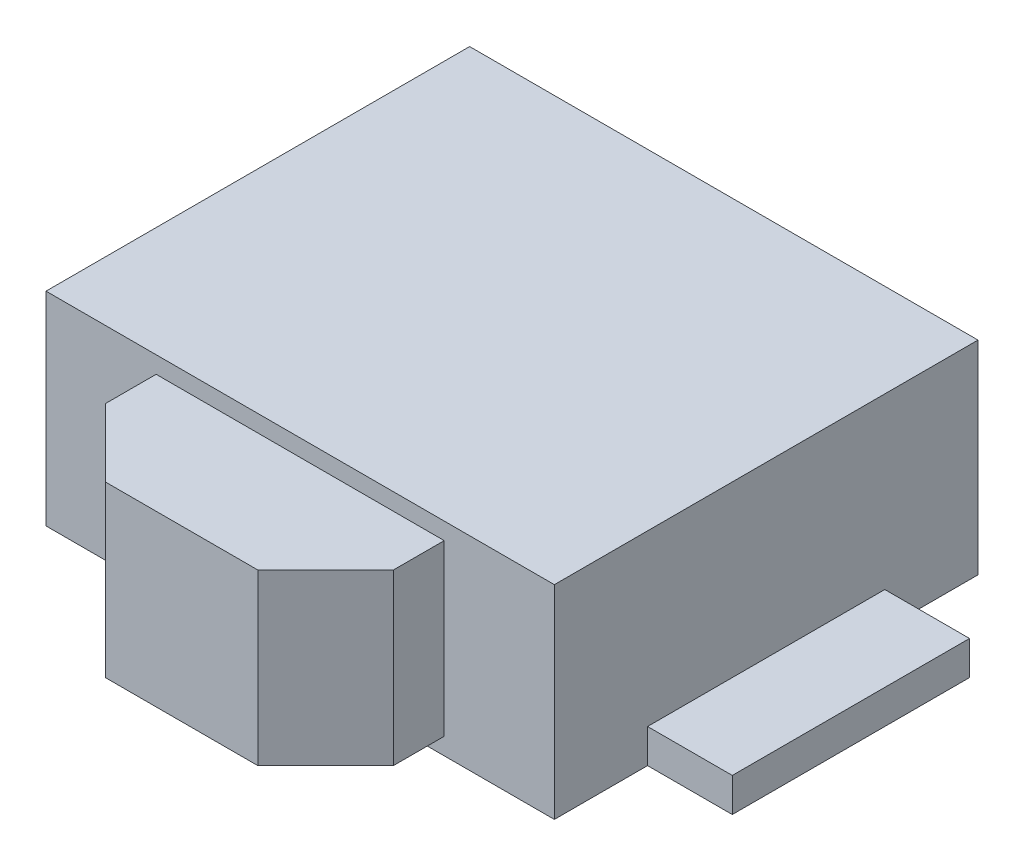
ISO-10303-21;
HEADER;
FILE_DESCRIPTION(('STEP AP214'),'2;1');
FILE_NAME('part.step','',(''),(''),'','','');
FILE_SCHEMA(('AUTOMOTIVE_DESIGN { 1 0 10303 214 1 1 1 1 }'));
ENDSEC;
DATA;
#1=APPLICATION_CONTEXT('core data for automotive mechanical design processes');
#2=APPLICATION_PROTOCOL_DEFINITION('international standard','automotive_design',2000,#1);
#3=PRODUCT_CONTEXT('',#1,'mechanical');
#4=PRODUCT('Part','Part','',(#3));
#5=PRODUCT_RELATED_PRODUCT_CATEGORY('part','',(#4));
#6=PRODUCT_DEFINITION_FORMATION('','',#4);
#7=PRODUCT_DEFINITION_CONTEXT('part definition',#1,'design');
#8=PRODUCT_DEFINITION('design','',#6,#7);
#9=PRODUCT_DEFINITION_SHAPE('','',#8);
#10=(LENGTH_UNIT() NAMED_UNIT(*) SI_UNIT(.MILLI.,.METRE.));
#11=(NAMED_UNIT(*) PLANE_ANGLE_UNIT() SI_UNIT($,.RADIAN.));
#12=(NAMED_UNIT(*) SI_UNIT($,.STERADIAN.) SOLID_ANGLE_UNIT());
#13=UNCERTAINTY_MEASURE_WITH_UNIT(LENGTH_MEASURE(1.E-05),#10,'distance_accuracy_value','');
#14=(GEOMETRIC_REPRESENTATION_CONTEXT(3) GLOBAL_UNCERTAINTY_ASSIGNED_CONTEXT((#13)) GLOBAL_UNIT_ASSIGNED_CONTEXT((#10,
#11,#12)) REPRESENTATION_CONTEXT('',''));
#15=CARTESIAN_POINT('',(0.,0.,0.));
#16=DIRECTION('',(0.,0.,1.));
#17=DIRECTION('',(1.,0.,0.));
#18=AXIS2_PLACEMENT_3D('',#15,#16,#17);
#19=CARTESIAN_POINT('',(0.,0.60446823428369,1.4360825383478));
#20=DIRECTION('',(0.,0.,1.));
#21=DIRECTION('',(1.,0.,0.));
#22=AXIS2_PLACEMENT_3D('',#19,#20,#21);
#23=PLANE('',#22);
#24=DIRECTION('',(0.,1.,0.));
#25=VECTOR('',#24,1.);
#26=CARTESIAN_POINT('',(0.991666666666667,0.60446823428369,1.4360825383478));
#27=LINE('',#26,#25);
#28=CARTESIAN_POINT('',(0.991666666666667,0.0211349009503572,1.4360825383478));
#29=VERTEX_POINT('',#28);
#30=CARTESIAN_POINT('',(0.991666666666667,1.18780156761702,1.4360825383478));
#31=VERTEX_POINT('',#30);
#32=EDGE_CURVE('E61',#29,#31,#27,.T.);
#33=ORIENTED_EDGE('',*,*,#32,.F.);
#34=DIRECTION('',(1.,0.,0.));
#35=VECTOR('',#34,1.);
#36=CARTESIAN_POINT('',(0.,0.0211349009503572,1.4360825383478));
#37=LINE('',#36,#35);
#38=CARTESIAN_POINT('',(-0.991666666666667,0.0211349009503572,1.4360825383478));
#39=VERTEX_POINT('',#38);
#40=EDGE_CURVE('E543',#39,#29,#37,.T.);
#41=ORIENTED_EDGE('',*,*,#40,.F.);
#42=DIRECTION('',(0.,-1.,0.));
#43=VECTOR('',#42,1.);
#44=CARTESIAN_POINT('',(-0.991666666666667,0.60446823428369,1.4360825383478));
#45=LINE('',#44,#43);
#46=CARTESIAN_POINT('',(-0.991666666666667,1.18780156761702,1.4360825383478));
#47=VERTEX_POINT('',#46);
#48=EDGE_CURVE('E535',#47,#39,#45,.T.);
#49=ORIENTED_EDGE('',*,*,#48,.F.);
#50=DIRECTION('',(-1.,0.,0.));
#51=VECTOR('',#50,1.);
#52=CARTESIAN_POINT('',(0.,1.18780156761702,1.4360825383478));
#53=LINE('',#52,#51);
#54=EDGE_CURVE('E539',#31,#47,#53,.T.);
#55=ORIENTED_EDGE('',*,*,#54,.F.);
#56=EDGE_LOOP('',(#33,#41,#49,#55));
#57=FACE_BOUND('',#56,.T.);
#58=DIRECTION('',(-1.,0.,0.));
#59=VECTOR('',#58,1.);
#60=CARTESIAN_POINT('',(0.,-0.0955317657163095,1.4360825383478));
#61=LINE('',#60,#59);
#62=CARTESIAN_POINT('',(1.75,-0.0955317657163095,1.4360825383478));
#63=VERTEX_POINT('',#62);
#64=CARTESIAN_POINT('',(-1.75,-0.0955317657163095,1.4360825383478));
#65=VERTEX_POINT('',#64);
#66=EDGE_CURVE('E519',#63,#65,#61,.T.);
#67=ORIENTED_EDGE('',*,*,#66,.F.);
#68=DIRECTION('',(0.,-1.,0.));
#69=VECTOR('',#68,1.);
#70=CARTESIAN_POINT('',(1.75,0.60446823428369,1.4360825383478));
#71=LINE('',#70,#69);
#72=CARTESIAN_POINT('',(1.75,1.30446823428369,1.4360825383478));
#73=VERTEX_POINT('',#72);
#74=EDGE_CURVE('E509',#73,#63,#71,.T.);
#75=ORIENTED_EDGE('',*,*,#74,.F.);
#76=DIRECTION('',(1.,0.,0.));
#77=VECTOR('',#76,1.);
#78=CARTESIAN_POINT('',(0.,1.30446823428369,1.4360825383478));
#79=LINE('',#78,#77);
#80=CARTESIAN_POINT('',(-1.75,1.30446823428369,1.4360825383478));
#81=VERTEX_POINT('',#80);
#82=EDGE_CURVE('E513',#81,#73,#79,.T.);
#83=ORIENTED_EDGE('',*,*,#82,.F.);
#84=DIRECTION('',(0.,1.,0.));
#85=VECTOR('',#84,1.);
#86=CARTESIAN_POINT('',(-1.75,0.60446823428369,1.4360825383478));
#87=LINE('',#86,#85);
#88=EDGE_CURVE('E516',#65,#81,#87,.T.);
#89=ORIENTED_EDGE('',*,*,#88,.F.);
#90=EDGE_LOOP('',(#67,#75,#83,#89));
#91=FACE_BOUND('',#90,.T.);
#92=ADVANCED_FACE('F38',(#57,#91),#23,.T.);
#93=CARTESIAN_POINT('',(0.,-0.0955317657163095,-1.48058412831887));
#94=DIRECTION('',(0.,-1.,0.));
#95=DIRECTION('',(0.,0.,-1.));
#96=AXIS2_PLACEMENT_3D('',#93,#94,#95);
#97=PLANE('',#96);
#98=CARTESIAN_POINT('',(0.,-0.0955317657163095,-0.0222507949855368));
#99=DIRECTION('',(0.,-1.,0.));
#100=DIRECTION('',(0.,0.,-1.));
#101=AXIS2_PLACEMENT_3D('',#98,#99,#100);
#102=CIRCLE('',#101,0.379166666666667);
#103=CARTESIAN_POINT('',(0.,-0.0955317657163095,-0.401417461652203));
#104=VERTEX_POINT('',#103);
#105=EDGE_CURVE('E548',#104,#104,#102,.T.);
#106=ORIENTED_EDGE('',*,*,#105,.F.);
#107=EDGE_LOOP('',(#106));
#108=FACE_BOUND('',#107,.T.);
#109=DIRECTION('',(0.,0.,1.));
#110=VECTOR('',#109,1.);
#111=CARTESIAN_POINT('',(1.75,-0.0955317657163095,-1.48058412831887));
#112=LINE('',#111,#110);
#113=CARTESIAN_POINT('',(1.75,-0.0955317657163095,-1.48058412831887));
#114=VERTEX_POINT('',#113);
#115=CARTESIAN_POINT('',(1.75,-0.0955317657163095,-0.838917461652204));
#116=VERTEX_POINT('',#115);
#117=EDGE_CURVE('E493',#114,#116,#112,.T.);
#118=ORIENTED_EDGE('',*,*,#117,.T.);
#119=DIRECTION('',(1.,0.,0.));
#120=VECTOR('',#119,1.);
#121=CARTESIAN_POINT('',(0.,-0.0955317657163095,-0.838917461652204));
#122=LINE('',#121,#120);
#123=CARTESIAN_POINT('',(2.33333333333333,-0.0955317657163095,-0.838917461652204));
#124=VERTEX_POINT('',#123);
#125=EDGE_CURVE('E413',#116,#124,#122,.T.);
#126=ORIENTED_EDGE('',*,*,#125,.T.);
#127=DIRECTION('',(0.,0.,1.));
#128=VECTOR('',#127,1.);
#129=CARTESIAN_POINT('',(2.33333333333333,-0.0955317657163095,-0.838917461652204));
#130=LINE('',#129,#128);
#131=CARTESIAN_POINT('',(2.33333333333333,-0.0955317657163095,0.79441587168113));
#132=VERTEX_POINT('',#131);
#133=EDGE_CURVE('E423',#124,#132,#130,.T.);
#134=ORIENTED_EDGE('',*,*,#133,.T.);
#135=DIRECTION('',(-1.,0.,0.));
#136=VECTOR('',#135,1.);
#137=CARTESIAN_POINT('',(0.,-0.0955317657163095,0.79441587168113));
#138=LINE('',#137,#136);
#139=CARTESIAN_POINT('',(1.75,-0.0955317657163095,0.79441587168113));
#140=VERTEX_POINT('',#139);
#141=EDGE_CURVE('E460',#132,#140,#138,.T.);
#142=ORIENTED_EDGE('',*,*,#141,.T.);
#143=EDGE_CURVE('E485',#140,#63,#112,.T.);
#144=ORIENTED_EDGE('',*,*,#143,.T.);
#145=ORIENTED_EDGE('',*,*,#66,.T.);
#146=DIRECTION('',(0.,0.,1.));
#147=VECTOR('',#146,1.);
#148=CARTESIAN_POINT('',(-1.75,-0.0955317657163095,-1.48058412831887));
#149=LINE('',#148,#147);
#150=CARTESIAN_POINT('',(-1.75,-0.0955317657163095,0.79441587168113));
#151=VERTEX_POINT('',#150);
#152=EDGE_CURVE('E505',#151,#65,#149,.T.);
#153=ORIENTED_EDGE('',*,*,#152,.F.);
#154=CARTESIAN_POINT('',(-2.33333333333333,-0.0955317657163095,0.79441587168113));
#155=VERTEX_POINT('',#154);
#156=EDGE_CURVE('E459',#151,#155,#138,.T.);
#157=ORIENTED_EDGE('',*,*,#156,.T.);
#158=DIRECTION('',(0.,0.,1.));
#159=VECTOR('',#158,1.);
#160=CARTESIAN_POINT('',(-2.33333333333333,-0.0955317657163095,-0.838917461652204));
#161=LINE('',#160,#159);
#162=CARTESIAN_POINT('',(-2.33333333333333,-0.0955317657163095,-0.838917461652204));
#163=VERTEX_POINT('',#162);
#164=EDGE_CURVE('E443',#163,#155,#161,.T.);
#165=ORIENTED_EDGE('',*,*,#164,.F.);
#166=CARTESIAN_POINT('',(-1.75,-0.0955317657163095,-0.838917461652204));
#167=VERTEX_POINT('',#166);
#168=EDGE_CURVE('E414',#163,#167,#122,.T.);
#169=ORIENTED_EDGE('',*,*,#168,.T.);
#170=CARTESIAN_POINT('',(-1.75,-0.0955317657163095,-1.48058412831887));
#171=VERTEX_POINT('',#170);
#172=EDGE_CURVE('E506',#171,#167,#149,.T.);
#173=ORIENTED_EDGE('',*,*,#172,.F.);
#174=DIRECTION('',(1.,0.,0.));
#175=VECTOR('',#174,1.);
#176=CARTESIAN_POINT('',(0.,-0.0955317657163095,-1.48058412831887));
#177=LINE('',#176,#175);
#178=EDGE_CURVE('E476',#171,#114,#177,.T.);
#179=ORIENTED_EDGE('',*,*,#178,.T.);
#180=EDGE_LOOP('',(#118,#126,#134,#142,#144,#145,#153,#157,#165,#169,#173,#179));
#181=FACE_BOUND('',#180,.T.);
#182=ADVANCED_FACE('F615',(#108,#181),#97,.T.);
#183=CARTESIAN_POINT('',(-1.75,0.60446823428369,-1.48058412831887));
#184=DIRECTION('',(-1.,0.,0.));
#185=DIRECTION('',(0.,0.,1.));
#186=AXIS2_PLACEMENT_3D('',#183,#184,#185);
#187=PLANE('',#186);
#188=DIRECTION('',(0.,1.,0.));
#189=VECTOR('',#188,1.);
#190=CARTESIAN_POINT('',(-1.75,0.60446823428369,0.79441587168113));
#191=LINE('',#190,#189);
#192=CARTESIAN_POINT('',(-1.75,0.137801567617024,0.79441587168113));
#193=VERTEX_POINT('',#192);
#194=EDGE_CURVE('E472',#151,#193,#191,.T.);
#195=ORIENTED_EDGE('',*,*,#194,.F.);
#196=ORIENTED_EDGE('',*,*,#152,.T.);
#197=ORIENTED_EDGE('',*,*,#88,.T.);
#198=DIRECTION('',(0.,0.,1.));
#199=VECTOR('',#198,1.);
#200=CARTESIAN_POINT('',(-1.75,1.30446823428369,-1.48058412831887));
#201=LINE('',#200,#199);
#202=CARTESIAN_POINT('',(-1.75,1.30446823428369,-1.48058412831887));
#203=VERTEX_POINT('',#202);
#204=EDGE_CURVE('E501',#203,#81,#201,.T.);
#205=ORIENTED_EDGE('',*,*,#204,.F.);
#206=DIRECTION('',(0.,-1.,0.));
#207=VECTOR('',#206,1.);
#208=CARTESIAN_POINT('',(-1.75,0.60446823428369,-1.48058412831887));
#209=LINE('',#208,#207);
#210=EDGE_CURVE('E480',#203,#171,#209,.T.);
#211=ORIENTED_EDGE('',*,*,#210,.T.);
#212=ORIENTED_EDGE('',*,*,#172,.T.);
#213=DIRECTION('',(0.,-1.,0.));
#214=VECTOR('',#213,1.);
#215=CARTESIAN_POINT('',(-1.75,0.60446823428369,-0.838917461652204));
#216=LINE('',#215,#214);
#217=CARTESIAN_POINT('',(-1.75,0.137801567617024,-0.838917461652204));
#218=VERTEX_POINT('',#217);
#219=EDGE_CURVE('E464',#218,#167,#216,.T.);
#220=ORIENTED_EDGE('',*,*,#219,.F.);
#221=DIRECTION('',(0.,0.,-1.));
#222=VECTOR('',#221,1.);
#223=CARTESIAN_POINT('',(-1.75,0.137801567617024,-1.48058412831887));
#224=LINE('',#223,#222);
#225=EDGE_CURVE('E468',#193,#218,#224,.T.);
#226=ORIENTED_EDGE('',*,*,#225,.F.);
#227=EDGE_LOOP('',(#195,#196,#197,#205,#211,#212,#220,#226));
#228=FACE_BOUND('',#227,.T.);
#229=ADVANCED_FACE('F619',(#228),#187,.T.);
#230=CARTESIAN_POINT('',(0.,1.30446823428369,-1.48058412831887));
#231=DIRECTION('',(0.,1.,0.));
#232=DIRECTION('',(0.,0.,1.));
#233=AXIS2_PLACEMENT_3D('',#230,#231,#232);
#234=PLANE('',#233);
#235=ORIENTED_EDGE('',*,*,#204,.T.);
#236=ORIENTED_EDGE('',*,*,#82,.T.);
#237=DIRECTION('',(0.,0.,1.));
#238=VECTOR('',#237,1.);
#239=CARTESIAN_POINT('',(1.75,1.30446823428369,-1.48058412831887));
#240=LINE('',#239,#238);
#241=CARTESIAN_POINT('',(1.75,1.30446823428369,-1.48058412831887));
#242=VERTEX_POINT('',#241);
#243=EDGE_CURVE('E497',#242,#73,#240,.T.);
#244=ORIENTED_EDGE('',*,*,#243,.F.);
#245=DIRECTION('',(-1.,0.,0.));
#246=VECTOR('',#245,1.);
#247=CARTESIAN_POINT('',(0.,1.30446823428369,-1.48058412831887));
#248=LINE('',#247,#246);
#249=EDGE_CURVE('E486',#242,#203,#248,.T.);
#250=ORIENTED_EDGE('',*,*,#249,.T.);
#251=EDGE_LOOP('',(#235,#236,#244,#250));
#252=FACE_BOUND('',#251,.T.);
#253=ADVANCED_FACE('F633',(#252),#234,.T.);
#254=CARTESIAN_POINT('',(0.,0.60446823428369,-1.48058412831887));
#255=DIRECTION('',(0.,0.,-1.));
#256=DIRECTION('',(-1.,0.,0.));
#257=AXIS2_PLACEMENT_3D('',#254,#255,#256);
#258=PLANE('',#257);
#259=DIRECTION('',(0.,-1.,0.));
#260=VECTOR('',#259,1.);
#261=CARTESIAN_POINT('',(0.291666666666667,0.60446823428369,-1.48058412831887));
#262=LINE('',#261,#260);
#263=CARTESIAN_POINT('',(0.291666666666667,1.07113490095036,-1.48058412831887));
#264=VERTEX_POINT('',#263);
#265=CARTESIAN_POINT('',(0.291666666666667,0.837801567617024,-1.48058412831887));
#266=VERTEX_POINT('',#265);
#267=EDGE_CURVE('E11',#264,#266,#262,.T.);
#268=ORIENTED_EDGE('',*,*,#267,.F.);
#269=DIRECTION('',(1.,0.,0.));
#270=VECTOR('',#269,1.);
#271=CARTESIAN_POINT('',(0.,1.07113490095036,-1.48058412831887));
#272=LINE('',#271,#270);
#273=CARTESIAN_POINT('',(-0.291666666666667,1.07113490095036,-1.48058412831887));
#274=VERTEX_POINT('',#273);
#275=EDGE_CURVE('E46',#274,#264,#272,.T.);
#276=ORIENTED_EDGE('',*,*,#275,.F.);
#277=DIRECTION('',(0.,-1.,0.));
#278=VECTOR('',#277,1.);
#279=CARTESIAN_POINT('',(-0.291666666666667,0.60446823428369,-1.48058412831887));
#280=LINE('',#279,#278);
#281=CARTESIAN_POINT('',(-0.291666666666667,0.837801567617024,-1.48058412831887));
#282=VERTEX_POINT('',#281);
#283=EDGE_CURVE('E552',#274,#282,#280,.T.);
#284=ORIENTED_EDGE('',*,*,#283,.T.);
#285=DIRECTION('',(1.,0.,0.));
#286=VECTOR('',#285,1.);
#287=CARTESIAN_POINT('',(0.,0.837801567617024,-1.48058412831887));
#288=LINE('',#287,#286);
#289=EDGE_CURVE('E556',#282,#266,#288,.T.);
#290=ORIENTED_EDGE('',*,*,#289,.T.);
#291=EDGE_LOOP('',(#268,#276,#284,#290));
#292=FACE_BOUND('',#291,.T.);
#293=DIRECTION('',(0.,1.,0.));
#294=VECTOR('',#293,1.);
#295=CARTESIAN_POINT('',(1.75,0.60446823428369,-1.48058412831887));
#296=LINE('',#295,#294);
#297=EDGE_CURVE('E481',#114,#242,#296,.T.);
#298=ORIENTED_EDGE('',*,*,#297,.F.);
#299=ORIENTED_EDGE('',*,*,#178,.F.);
#300=ORIENTED_EDGE('',*,*,#210,.F.);
#301=ORIENTED_EDGE('',*,*,#249,.F.);
#302=EDGE_LOOP('',(#298,#299,#300,#301));
#303=FACE_BOUND('',#302,.T.);
#304=ADVANCED_FACE('F573',(#292,#303),#258,.T.);
#305=CARTESIAN_POINT('',(1.75,0.60446823428369,-1.48058412831887));
#306=DIRECTION('',(1.,0.,0.));
#307=DIRECTION('',(0.,0.,-1.));
#308=AXIS2_PLACEMENT_3D('',#305,#306,#307);
#309=PLANE('',#308);
#310=DIRECTION('',(0.,-1.,0.));
#311=VECTOR('',#310,1.);
#312=CARTESIAN_POINT('',(1.75,0.60446823428369,0.79441587168113));
#313=LINE('',#312,#311);
#314=CARTESIAN_POINT('',(1.75,0.137801567617024,0.79441587168113));
#315=VERTEX_POINT('',#314);
#316=EDGE_CURVE('E531',#315,#140,#313,.T.);
#317=ORIENTED_EDGE('',*,*,#316,.F.);
#318=DIRECTION('',(0.,0.,1.));
#319=VECTOR('',#318,1.);
#320=CARTESIAN_POINT('',(1.75,0.137801567617024,-1.48058412831887));
#321=LINE('',#320,#319);
#322=CARTESIAN_POINT('',(1.75,0.137801567617024,-0.838917461652204));
#323=VERTEX_POINT('',#322);
#324=EDGE_CURVE('E527',#323,#315,#321,.T.);
#325=ORIENTED_EDGE('',*,*,#324,.F.);
#326=DIRECTION('',(0.,1.,0.));
#327=VECTOR('',#326,1.);
#328=CARTESIAN_POINT('',(1.75,0.60446823428369,-0.838917461652204));
#329=LINE('',#328,#327);
#330=EDGE_CURVE('E523',#116,#323,#329,.T.);
#331=ORIENTED_EDGE('',*,*,#330,.F.);
#332=ORIENTED_EDGE('',*,*,#117,.F.);
#333=ORIENTED_EDGE('',*,*,#297,.T.);
#334=ORIENTED_EDGE('',*,*,#243,.T.);
#335=ORIENTED_EDGE('',*,*,#74,.T.);
#336=ORIENTED_EDGE('',*,*,#143,.F.);
#337=EDGE_LOOP('',(#317,#325,#331,#332,#333,#334,#335,#336));
#338=FACE_BOUND('',#337,.T.);
#339=ADVANCED_FACE('F629',(#338),#309,.T.);
#340=CARTESIAN_POINT('',(2.33333333333333,0.0211349009503572,-0.838917461652204));
#341=DIRECTION('',(1.,0.,0.));
#342=DIRECTION('',(0.,0.,-1.));
#343=AXIS2_PLACEMENT_3D('',#340,#341,#342);
#344=PLANE('',#343);
#345=DIRECTION('',(0.,1.,0.));
#346=VECTOR('',#345,1.);
#347=CARTESIAN_POINT('',(2.33333333333333,0.0211349009503572,-0.838917461652204));
#348=LINE('',#347,#346);
#349=CARTESIAN_POINT('',(2.33333333333333,0.137801567617024,-0.838917461652204));
#350=VERTEX_POINT('',#349);
#351=EDGE_CURVE('E419',#124,#350,#348,.T.);
#352=ORIENTED_EDGE('',*,*,#351,.T.);
#353=DIRECTION('',(0.,0.,1.));
#354=VECTOR('',#353,1.);
#355=CARTESIAN_POINT('',(2.33333333333333,0.137801567617024,-0.838917461652204));
#356=LINE('',#355,#354);
#357=CARTESIAN_POINT('',(2.33333333333333,0.137801567617024,0.79441587168113));
#358=VERTEX_POINT('',#357);
#359=EDGE_CURVE('E435',#350,#358,#356,.T.);
#360=ORIENTED_EDGE('',*,*,#359,.T.);
#361=DIRECTION('',(0.,-1.,0.));
#362=VECTOR('',#361,1.);
#363=CARTESIAN_POINT('',(2.33333333333333,0.0211349009503572,0.79441587168113));
#364=LINE('',#363,#362);
#365=EDGE_CURVE('E447',#358,#132,#364,.T.);
#366=ORIENTED_EDGE('',*,*,#365,.T.);
#367=ORIENTED_EDGE('',*,*,#133,.F.);
#368=EDGE_LOOP('',(#352,#360,#366,#367));
#369=FACE_BOUND('',#368,.T.);
#370=ADVANCED_FACE('F944',(#369),#344,.T.);
#371=CARTESIAN_POINT('',(0.,0.0211349009503572,-0.838917461652204));
#372=DIRECTION('',(0.,0.,-1.));
#373=DIRECTION('',(-1.,0.,0.));
#374=AXIS2_PLACEMENT_3D('',#371,#372,#373);
#375=PLANE('',#374);
#376=ORIENTED_EDGE('',*,*,#125,.F.);
#377=ORIENTED_EDGE('',*,*,#330,.T.);
#378=DIRECTION('',(-1.,0.,0.));
#379=VECTOR('',#378,1.);
#380=CARTESIAN_POINT('',(0.,0.137801567617024,-0.838917461652204));
#381=LINE('',#380,#379);
#382=EDGE_CURVE('E424',#350,#323,#381,.T.);
#383=ORIENTED_EDGE('',*,*,#382,.F.);
#384=ORIENTED_EDGE('',*,*,#351,.F.);
#385=EDGE_LOOP('',(#376,#377,#383,#384));
#386=FACE_BOUND('',#385,.T.);
#387=ADVANCED_FACE('F672',(#386),#375,.T.);
#388=CARTESIAN_POINT('',(0.,0.137801567617024,-0.838917461652204));
#389=DIRECTION('',(0.,1.,0.));
#390=DIRECTION('',(0.,0.,1.));
#391=AXIS2_PLACEMENT_3D('',#388,#389,#390);
#392=PLANE('',#391);
#393=ORIENTED_EDGE('',*,*,#382,.T.);
#394=ORIENTED_EDGE('',*,*,#324,.T.);
#395=DIRECTION('',(1.,0.,0.));
#396=VECTOR('',#395,1.);
#397=CARTESIAN_POINT('',(0.,0.137801567617024,0.79441587168113));
#398=LINE('',#397,#396);
#399=EDGE_CURVE('E451',#315,#358,#398,.T.);
#400=ORIENTED_EDGE('',*,*,#399,.T.);
#401=ORIENTED_EDGE('',*,*,#359,.F.);
#402=EDGE_LOOP('',(#393,#394,#400,#401));
#403=FACE_BOUND('',#402,.T.);
#404=ADVANCED_FACE('F911',(#403),#392,.T.);
#405=CARTESIAN_POINT('',(0.,0.0211349009503572,0.79441587168113));
#406=DIRECTION('',(0.,0.,1.));
#407=DIRECTION('',(1.,0.,0.));
#408=AXIS2_PLACEMENT_3D('',#405,#406,#407);
#409=PLANE('',#408);
#410=ORIENTED_EDGE('',*,*,#399,.F.);
#411=ORIENTED_EDGE('',*,*,#316,.T.);
#412=ORIENTED_EDGE('',*,*,#141,.F.);
#413=ORIENTED_EDGE('',*,*,#365,.F.);
#414=EDGE_LOOP('',(#410,#411,#412,#413));
#415=FACE_BOUND('',#414,.T.);
#416=ADVANCED_FACE('F919',(#415),#409,.T.);
#417=ORIENTED_EDGE('',*,*,#156,.F.);
#418=ORIENTED_EDGE('',*,*,#194,.T.);
#419=CARTESIAN_POINT('',(-2.33333333333333,0.137801567617024,0.79441587168113));
#420=VERTEX_POINT('',#419);
#421=EDGE_CURVE('E452',#420,#193,#398,.T.);
#422=ORIENTED_EDGE('',*,*,#421,.F.);
#423=DIRECTION('',(0.,1.,0.));
#424=VECTOR('',#423,1.);
#425=CARTESIAN_POINT('',(-2.33333333333333,0.0211349009503572,0.79441587168113));
#426=LINE('',#425,#424);
#427=EDGE_CURVE('E456',#155,#420,#426,.T.);
#428=ORIENTED_EDGE('',*,*,#427,.F.);
#429=EDGE_LOOP('',(#417,#418,#422,#428));
#430=FACE_BOUND('',#429,.T.);
#431=ADVANCED_FACE('F659',(#430),#409,.T.);
#432=ORIENTED_EDGE('',*,*,#421,.T.);
#433=ORIENTED_EDGE('',*,*,#225,.T.);
#434=CARTESIAN_POINT('',(-2.33333333333333,0.137801567617024,-0.838917461652204));
#435=VERTEX_POINT('',#434);
#436=EDGE_CURVE('E428',#218,#435,#381,.T.);
#437=ORIENTED_EDGE('',*,*,#436,.T.);
#438=DIRECTION('',(0.,0.,1.));
#439=VECTOR('',#438,1.);
#440=CARTESIAN_POINT('',(-2.33333333333333,0.137801567617024,-0.838917461652204));
#441=LINE('',#440,#439);
#442=EDGE_CURVE('E439',#435,#420,#441,.T.);
#443=ORIENTED_EDGE('',*,*,#442,.T.);
#444=EDGE_LOOP('',(#432,#433,#437,#443));
#445=FACE_BOUND('',#444,.T.);
#446=ADVANCED_FACE('F900',(#445),#392,.T.);
#447=ORIENTED_EDGE('',*,*,#436,.F.);
#448=ORIENTED_EDGE('',*,*,#219,.T.);
#449=ORIENTED_EDGE('',*,*,#168,.F.);
#450=DIRECTION('',(0.,-1.,0.));
#451=VECTOR('',#450,1.);
#452=CARTESIAN_POINT('',(-2.33333333333333,0.0211349009503572,-0.838917461652204));
#453=LINE('',#452,#451);
#454=EDGE_CURVE('E418',#435,#163,#453,.T.);
#455=ORIENTED_EDGE('',*,*,#454,.F.);
#456=EDGE_LOOP('',(#447,#448,#449,#455));
#457=FACE_BOUND('',#456,.T.);
#458=ADVANCED_FACE('F667',(#457),#375,.T.);
#459=CARTESIAN_POINT('',(-2.33333333333333,0.0211349009503572,-0.838917461652204));
#460=DIRECTION('',(-1.,0.,0.));
#461=DIRECTION('',(0.,0.,1.));
#462=AXIS2_PLACEMENT_3D('',#459,#460,#461);
#463=PLANE('',#462);
#464=ORIENTED_EDGE('',*,*,#164,.T.);
#465=ORIENTED_EDGE('',*,*,#427,.T.);
#466=ORIENTED_EDGE('',*,*,#442,.F.);
#467=ORIENTED_EDGE('',*,*,#454,.T.);
#468=EDGE_LOOP('',(#464,#465,#466,#467));
#469=FACE_BOUND('',#468,.T.);
#470=ADVANCED_FACE('F662',(#469),#463,.T.);
#471=CARTESIAN_POINT('',(0.,0.60446823428369,2.25274920501446));
#472=DIRECTION('',(0.,0.,1.));
#473=DIRECTION('',(1.,0.,0.));
#474=AXIS2_PLACEMENT_3D('',#471,#472,#473);
#475=PLANE('',#474);
#476=DIRECTION('',(-1.,0.,0.));
#477=VECTOR('',#476,1.);
#478=CARTESIAN_POINT('',(0.,0.0211349009503572,2.25274920501446));
#479=LINE('',#478,#477);
#480=CARTESIAN_POINT('',(0.525,0.0211349009503572,2.25274920501446));
#481=VERTEX_POINT('',#480);
#482=CARTESIAN_POINT('',(-0.525,0.0211349009503572,2.25274920501446));
#483=VERTEX_POINT('',#482);
#484=EDGE_CURVE('E406',#481,#483,#479,.T.);
#485=ORIENTED_EDGE('',*,*,#484,.F.);
#486=DIRECTION('',(0.,-1.,0.));
#487=VECTOR('',#486,1.);
#488=CARTESIAN_POINT('',(0.525,3.40446823428369,2.25274920501446));
#489=LINE('',#488,#487);
#490=CARTESIAN_POINT('',(0.525,1.18780156761702,2.25274920501446));
#491=VERTEX_POINT('',#490);
#492=EDGE_CURVE('E363',#491,#481,#489,.T.);
#493=ORIENTED_EDGE('',*,*,#492,.F.);
#494=DIRECTION('',(1.,0.,0.));
#495=VECTOR('',#494,1.);
#496=CARTESIAN_POINT('',(0.,1.18780156761702,2.25274920501446));
#497=LINE('',#496,#495);
#498=CARTESIAN_POINT('',(-0.525,1.18780156761702,2.25274920501446));
#499=VERTEX_POINT('',#498);
#500=EDGE_CURVE('E402',#499,#491,#497,.T.);
#501=ORIENTED_EDGE('',*,*,#500,.F.);
#502=DIRECTION('',(0.,-1.,0.));
#503=VECTOR('',#502,1.);
#504=CARTESIAN_POINT('',(-0.525,3.40446823428369,2.25274920501446));
#505=LINE('',#504,#503);
#506=EDGE_CURVE('E382',#499,#483,#505,.T.);
#507=ORIENTED_EDGE('',*,*,#506,.T.);
#508=EDGE_LOOP('',(#485,#493,#501,#507));
#509=FACE_BOUND('',#508,.T.);
#510=ADVANCED_FACE('F873',(#509),#475,.T.);
#511=CARTESIAN_POINT('',(0.,0.0211349009503572,-0.0222507949855368));
#512=DIRECTION('',(0.,-1.,0.));
#513=DIRECTION('',(0.,0.,-1.));
#514=AXIS2_PLACEMENT_3D('',#511,#512,#513);
#515=PLANE('',#514);
#516=DIRECTION('',(0.,0.,1.));
#517=VECTOR('',#516,1.);
#518=CARTESIAN_POINT('',(-0.991666666666667,0.0211349009503572,-0.0222507949855368));
#519=LINE('',#518,#517);
#520=CARTESIAN_POINT('',(-0.991666666666667,0.0211349009503572,1.7860825383478));
#521=VERTEX_POINT('',#520);
#522=EDGE_CURVE('E399',#39,#521,#519,.T.);
#523=ORIENTED_EDGE('',*,*,#522,.F.);
#524=ORIENTED_EDGE('',*,*,#40,.T.);
#525=DIRECTION('',(0.,0.,1.));
#526=VECTOR('',#525,1.);
#527=CARTESIAN_POINT('',(0.991666666666667,0.0211349009503572,-0.0222507949855368));
#528=LINE('',#527,#526);
#529=CARTESIAN_POINT('',(0.991666666666667,0.0211349009503572,1.7860825383478));
#530=VERTEX_POINT('',#529);
#531=EDGE_CURVE('E390',#29,#530,#528,.T.);
#532=ORIENTED_EDGE('',*,*,#531,.T.);
#533=DIRECTION('',(-0.707106781186548,0.,0.707106781186548));
#534=VECTOR('',#533,1.);
#535=CARTESIAN_POINT('',(1.4,0.0211349009503572,1.37774920501446));
#536=LINE('',#535,#534);
#537=EDGE_CURVE('E374',#530,#481,#536,.T.);
#538=ORIENTED_EDGE('',*,*,#537,.T.);
#539=ORIENTED_EDGE('',*,*,#484,.T.);
#540=DIRECTION('',(-0.707106781186548,0.,-0.707106781186548));
#541=VECTOR('',#540,1.);
#542=CARTESIAN_POINT('',(-1.4,0.0211349009503572,1.37774920501446));
#543=LINE('',#542,#541);
#544=EDGE_CURVE('E386',#483,#521,#543,.T.);
#545=ORIENTED_EDGE('',*,*,#544,.T.);
#546=EDGE_LOOP('',(#523,#524,#532,#538,#539,#545));
#547=FACE_BOUND('',#546,.T.);
#548=ADVANCED_FACE('F863',(#547),#515,.T.);
#549=CARTESIAN_POINT('',(0.,1.18780156761702,-0.0222507949855368));
#550=DIRECTION('',(0.,1.,0.));
#551=DIRECTION('',(0.,0.,1.));
#552=AXIS2_PLACEMENT_3D('',#549,#550,#551);
#553=PLANE('',#552);
#554=DIRECTION('',(0.,0.,1.));
#555=VECTOR('',#554,1.);
#556=CARTESIAN_POINT('',(0.991666666666667,1.18780156761702,-0.0222507949855368));
#557=LINE('',#556,#555);
#558=CARTESIAN_POINT('',(0.991666666666667,1.18780156761702,1.7860825383478));
#559=VERTEX_POINT('',#558);
#560=EDGE_CURVE('E393',#31,#559,#557,.T.);
#561=ORIENTED_EDGE('',*,*,#560,.F.);
#562=ORIENTED_EDGE('',*,*,#54,.T.);
#563=DIRECTION('',(0.,0.,1.));
#564=VECTOR('',#563,1.);
#565=CARTESIAN_POINT('',(-0.991666666666667,1.18780156761702,-0.0222507949855368));
#566=LINE('',#565,#564);
#567=CARTESIAN_POINT('',(-0.991666666666667,1.18780156761702,1.7860825383478));
#568=VERTEX_POINT('',#567);
#569=EDGE_CURVE('E396',#47,#568,#566,.T.);
#570=ORIENTED_EDGE('',*,*,#569,.T.);
#571=DIRECTION('',(0.707106781186548,0.,0.707106781186548));
#572=VECTOR('',#571,1.);
#573=CARTESIAN_POINT('',(-1.4,1.18780156761702,1.37774920501446));
#574=LINE('',#573,#572);
#575=EDGE_CURVE('E409',#568,#499,#574,.T.);
#576=ORIENTED_EDGE('',*,*,#575,.T.);
#577=ORIENTED_EDGE('',*,*,#500,.T.);
#578=DIRECTION('',(0.707106781186548,0.,-0.707106781186548));
#579=VECTOR('',#578,1.);
#580=CARTESIAN_POINT('',(1.4,1.18780156761702,1.37774920501446));
#581=LINE('',#580,#579);
#582=EDGE_CURVE('E370',#491,#559,#581,.T.);
#583=ORIENTED_EDGE('',*,*,#582,.T.);
#584=EDGE_LOOP('',(#561,#562,#570,#576,#577,#583));
#585=FACE_BOUND('',#584,.T.);
#586=ADVANCED_FACE('F853',(#585),#553,.T.);
#587=CARTESIAN_POINT('',(0.991666666666667,0.60446823428369,-0.0222507949855368));
#588=DIRECTION('',(1.,0.,0.));
#589=DIRECTION('',(0.,0.,-1.));
#590=AXIS2_PLACEMENT_3D('',#587,#588,#589);
#591=PLANE('',#590);
#592=ORIENTED_EDGE('',*,*,#531,.F.);
#593=ORIENTED_EDGE('',*,*,#32,.T.);
#594=ORIENTED_EDGE('',*,*,#560,.T.);
#595=DIRECTION('',(0.,-1.,0.));
#596=VECTOR('',#595,1.);
#597=CARTESIAN_POINT('',(0.991666666666667,3.40446823428369,1.7860825383478));
#598=LINE('',#597,#596);
#599=EDGE_CURVE('E366',#559,#530,#598,.T.);
#600=ORIENTED_EDGE('',*,*,#599,.T.);
#601=EDGE_LOOP('',(#592,#593,#594,#600));
#602=FACE_BOUND('',#601,.T.);
#603=ADVANCED_FACE('F843',(#602),#591,.T.);
#604=CARTESIAN_POINT('',(-0.991666666666667,0.60446823428369,-0.0222507949855368));
#605=DIRECTION('',(-1.,0.,0.));
#606=DIRECTION('',(0.,0.,1.));
#607=AXIS2_PLACEMENT_3D('',#604,#605,#606);
#608=PLANE('',#607);
#609=ORIENTED_EDGE('',*,*,#569,.F.);
#610=ORIENTED_EDGE('',*,*,#48,.T.);
#611=ORIENTED_EDGE('',*,*,#522,.T.);
#612=DIRECTION('',(0.,-1.,0.));
#613=VECTOR('',#612,1.);
#614=CARTESIAN_POINT('',(-0.991666666666667,3.40446823428369,1.7860825383478));
#615=LINE('',#614,#613);
#616=EDGE_CURVE('E378',#568,#521,#615,.T.);
#617=ORIENTED_EDGE('',*,*,#616,.F.);
#618=EDGE_LOOP('',(#609,#610,#611,#617));
#619=FACE_BOUND('',#618,.T.);
#620=ADVANCED_FACE('F833',(#619),#608,.T.);
#621=CARTESIAN_POINT('',(-0.525,3.40446823428369,2.25274920501446));
#622=DIRECTION('',(-0.707106781186548,0.,0.707106781186548));
#623=DIRECTION('',(0.707106781186548,0.,0.707106781186548));
#624=AXIS2_PLACEMENT_3D('',#621,#622,#623);
#625=PLANE('',#624);
#626=ORIENTED_EDGE('',*,*,#506,.F.);
#627=ORIENTED_EDGE('',*,*,#575,.F.);
#628=ORIENTED_EDGE('',*,*,#616,.T.);
#629=ORIENTED_EDGE('',*,*,#544,.F.);
#630=EDGE_LOOP('',(#626,#627,#628,#629));
#631=FACE_BOUND('',#630,.T.);
#632=ADVANCED_FACE('F823',(#631),#625,.T.);
#633=CARTESIAN_POINT('',(0.991666666666667,3.40446823428369,1.7860825383478));
#634=DIRECTION('',(0.707106781186548,0.,0.707106781186548));
#635=DIRECTION('',(0.707106781186548,0.,-0.707106781186548));
#636=AXIS2_PLACEMENT_3D('',#633,#634,#635);
#637=PLANE('',#636);
#638=ORIENTED_EDGE('',*,*,#599,.F.);
#639=ORIENTED_EDGE('',*,*,#582,.F.);
#640=ORIENTED_EDGE('',*,*,#492,.T.);
#641=ORIENTED_EDGE('',*,*,#537,.F.);
#642=EDGE_LOOP('',(#638,#639,#640,#641));
#643=FACE_BOUND('',#642,.T.);
#644=ADVANCED_FACE('F813',(#643),#637,.T.);
#645=CARTESIAN_POINT('',(0.,-0.678865099049643,-0.0222507949855368));
#646=DIRECTION('',(0.,1.,0.));
#647=DIRECTION('',(1.,0.,0.));
#648=AXIS2_PLACEMENT_3D('',#645,#646,#647);
#649=CYLINDRICAL_SURFACE('',#648,0.379166666666667);
#650=ORIENTED_EDGE('',*,*,#105,.T.);
#651=EDGE_LOOP('',(#650));
#652=FACE_BOUND('',#651,.T.);
#653=CARTESIAN_POINT('',(0.,-0.503865099049643,-0.0222507949855368));
#654=DIRECTION('',(0.,1.,0.));
#655=DIRECTION('',(0.,0.,1.));
#656=AXIS2_PLACEMENT_3D('',#653,#654,#655);
#657=CIRCLE('',#656,0.379166666666667);
#658=CARTESIAN_POINT('',(0.,-0.503865099049643,0.35691587168113));
#659=VERTEX_POINT('',#658);
#660=EDGE_CURVE('E359',#659,#659,#657,.T.);
#661=ORIENTED_EDGE('',*,*,#660,.T.);
#662=EDGE_LOOP('',(#661));
#663=FACE_BOUND('',#662,.T.);
#664=ADVANCED_FACE('F803',(#652,#663),#649,.T.);
#665=CARTESIAN_POINT('',(0.,-0.503865099049643,-0.0222507949855368));
#666=DIRECTION('',(0.,1.,0.));
#667=DIRECTION('',(0.,0.,1.));
#668=AXIS2_PLACEMENT_3D('',#665,#666,#667);
#669=CONICAL_SURFACE('',#668,0.379166666666667,0.785398163397448);
#670=CARTESIAN_POINT('',(0.,-0.678865099049643,-0.0222507949855368));
#671=DIRECTION('',(0.,1.,0.));
#672=DIRECTION('',(0.,0.,1.));
#673=AXIS2_PLACEMENT_3D('',#670,#671,#672);
#674=CIRCLE('',#673,0.204166666666667);
#675=CARTESIAN_POINT('',(0.,-0.678865099049643,0.18191587168113));
#676=VERTEX_POINT('',#675);
#677=EDGE_CURVE('E329',#676,#676,#674,.T.);
#678=ORIENTED_EDGE('',*,*,#677,.T.);
#679=EDGE_LOOP('',(#678));
#680=FACE_BOUND('',#679,.T.);
#681=ORIENTED_EDGE('',*,*,#660,.F.);
#682=EDGE_LOOP('',(#681));
#683=FACE_BOUND('',#682,.T.);
#684=ADVANCED_FACE('F793',(#680,#683),#669,.T.);
#685=CARTESIAN_POINT('',(0.,-0.678865099049643,-0.0222507949855368));
#686=DIRECTION('',(0.,-1.,0.));
#687=DIRECTION('',(0.,0.,-1.));
#688=AXIS2_PLACEMENT_3D('',#685,#686,#687);
#689=PLANE('',#688);
#690=ORIENTED_EDGE('',*,*,#677,.F.);
#691=EDGE_LOOP('',(#690));
#692=FACE_BOUND('',#691,.T.);
#693=ADVANCED_FACE('F784',(#692),#689,.T.);
#694=CARTESIAN_POINT('',(0.291666666666667,0.137801567617024,-2.2389174616522));
#695=DIRECTION('',(0.,-1.,0.));
#696=DIRECTION('',(0.,0.,-1.));
#697=AXIS2_PLACEMENT_3D('',#694,#695,#696);
#698=PLANE('',#697);
#699=DIRECTION('',(0.,0.,1.));
#700=VECTOR('',#699,1.);
#701=CARTESIAN_POINT('',(-0.291666666666667,0.137801567617024,-2.2389174616522));
#702=LINE('',#701,#700);
#703=CARTESIAN_POINT('',(-0.291666666666667,0.137801567617024,-2.2389174616522));
#704=VERTEX_POINT('',#703);
#705=CARTESIAN_POINT('',(-0.291666666666667,0.137801567617024,-1.8889174616522));
#706=VERTEX_POINT('',#705);
#707=EDGE_CURVE('E261',#704,#706,#702,.T.);
#708=ORIENTED_EDGE('',*,*,#707,.T.);
#709=DIRECTION('',(-1.,0.,0.));
#710=VECTOR('',#709,1.);
#711=CARTESIAN_POINT('',(0.291666666666667,0.137801567617024,-1.8889174616522));
#712=LINE('',#711,#710);
#713=CARTESIAN_POINT('',(0.291666666666667,0.137801567617024,-1.8889174616522));
#714=VERTEX_POINT('',#713);
#715=EDGE_CURVE('E326',#714,#706,#712,.T.);
#716=ORIENTED_EDGE('',*,*,#715,.F.);
#717=DIRECTION('',(0.,0.,1.));
#718=VECTOR('',#717,1.);
#719=CARTESIAN_POINT('',(0.291666666666667,0.137801567617024,-2.2389174616522));
#720=LINE('',#719,#718);
#721=CARTESIAN_POINT('',(0.291666666666667,0.137801567617024,-2.2389174616522));
#722=VERTEX_POINT('',#721);
#723=EDGE_CURVE('E263',#722,#714,#720,.T.);
#724=ORIENTED_EDGE('',*,*,#723,.F.);
#725=DIRECTION('',(-1.,0.,0.));
#726=VECTOR('',#725,1.);
#727=CARTESIAN_POINT('',(0.291666666666667,0.137801567617024,-2.2389174616522));
#728=LINE('',#727,#726);
#729=EDGE_CURVE('E255',#722,#704,#728,.T.);
#730=ORIENTED_EDGE('',*,*,#729,.T.);
#731=EDGE_LOOP('',(#708,#716,#724,#730));
#732=FACE_BOUND('',#731,.T.);
#733=ADVANCED_FACE('F594',(#732),#698,.F.);
#734=CARTESIAN_POINT('',(0.291666666666667,0.196134900950357,-1.8889174616522));
#735=DIRECTION('',(-1.,0.,0.));
#736=DIRECTION('',(0.,0.,1.));
#737=AXIS2_PLACEMENT_3D('',#734,#735,#736);
#738=CYLINDRICAL_SURFACE('',#737,0.0583333333333333);
#739=CARTESIAN_POINT('',(-0.291666666666667,0.196134900950357,-1.8889174616522));
#740=DIRECTION('',(1.,0.,0.));
#741=DIRECTION('',(0.,0.,-1.));
#742=AXIS2_PLACEMENT_3D('',#739,#740,#741);
#743=CIRCLE('',#742,0.0583333333333333);
#744=CARTESIAN_POINT('',(-0.291666666666667,0.196134900950357,-1.83058412831887));
#745=VERTEX_POINT('',#744);
#746=EDGE_CURVE('E292',#745,#706,#743,.T.);
#747=ORIENTED_EDGE('',*,*,#746,.F.);
#748=DIRECTION('',(-1.,0.,0.));
#749=VECTOR('',#748,1.);
#750=CARTESIAN_POINT('',(0.291666666666667,0.196134900950357,-1.83058412831887));
#751=LINE('',#750,#749);
#752=CARTESIAN_POINT('',(0.291666666666667,0.196134900950357,-1.83058412831887));
#753=VERTEX_POINT('',#752);
#754=EDGE_CURVE('E330',#753,#745,#751,.T.);
#755=ORIENTED_EDGE('',*,*,#754,.F.);
#756=CARTESIAN_POINT('',(0.291666666666667,0.196134900950357,-1.8889174616522));
#757=DIRECTION('',(1.,0.,0.));
#758=DIRECTION('',(0.,0.,-1.));
#759=AXIS2_PLACEMENT_3D('',#756,#757,#758);
#760=CIRCLE('',#759,0.0583333333333333);
#761=EDGE_CURVE('E269',#753,#714,#760,.T.);
#762=ORIENTED_EDGE('',*,*,#761,.T.);
#763=ORIENTED_EDGE('',*,*,#715,.T.);
#764=EDGE_LOOP('',(#747,#755,#762,#763));
#765=FACE_BOUND('',#764,.T.);
#766=ADVANCED_FACE('F597',(#765),#738,.F.);
#767=CARTESIAN_POINT('',(0.291666666666667,0.196134900950357,-1.83058412831887));
#768=DIRECTION('',(0.,0.,1.));
#769=DIRECTION('',(1.,0.,0.));
#770=AXIS2_PLACEMENT_3D('',#767,#768,#769);
#771=PLANE('',#770);
#772=DIRECTION('',(0.,1.,0.));
#773=VECTOR('',#772,1.);
#774=CARTESIAN_POINT('',(-0.291666666666667,0.196134900950357,-1.83058412831887));
#775=LINE('',#774,#773);
#776=CARTESIAN_POINT('',(-0.291666666666667,0.779468234283691,-1.83058412831887));
#777=VERTEX_POINT('',#776);
#778=EDGE_CURVE('E289',#745,#777,#775,.T.);
#779=ORIENTED_EDGE('',*,*,#778,.T.);
#780=DIRECTION('',(-1.,0.,0.));
#781=VECTOR('',#780,1.);
#782=CARTESIAN_POINT('',(0.291666666666667,0.779468234283691,-1.83058412831887));
#783=LINE('',#782,#781);
#784=CARTESIAN_POINT('',(0.291666666666667,0.779468234283691,-1.83058412831887));
#785=VERTEX_POINT('',#784);
#786=EDGE_CURVE('E333',#785,#777,#783,.T.);
#787=ORIENTED_EDGE('',*,*,#786,.F.);
#788=DIRECTION('',(0.,1.,0.));
#789=VECTOR('',#788,1.);
#790=CARTESIAN_POINT('',(0.291666666666667,0.196134900950357,-1.83058412831887));
#791=LINE('',#790,#789);
#792=EDGE_CURVE('E320',#753,#785,#791,.T.);
#793=ORIENTED_EDGE('',*,*,#792,.F.);
#794=ORIENTED_EDGE('',*,*,#754,.T.);
#795=EDGE_LOOP('',(#779,#787,#793,#794));
#796=FACE_BOUND('',#795,.T.);
#797=ADVANCED_FACE('F601',(#796),#771,.F.);
#798=CARTESIAN_POINT('',(0.291666666666667,0.779468234283691,-1.5389174616522));
#799=DIRECTION('',(-1.,0.,0.));
#800=DIRECTION('',(0.,0.,1.));
#801=AXIS2_PLACEMENT_3D('',#798,#799,#800);
#802=CYLINDRICAL_SURFACE('',#801,0.291666666666667);
#803=CARTESIAN_POINT('',(-0.291666666666667,0.779468234283691,-1.5389174616522));
#804=DIRECTION('',(1.,0.,0.));
#805=DIRECTION('',(0.,0.,-1.));
#806=AXIS2_PLACEMENT_3D('',#803,#804,#805);
#807=CIRCLE('',#806,0.291666666666667);
#808=CARTESIAN_POINT('',(-0.291666666666667,1.07113490095036,-1.5389174616522));
#809=VERTEX_POINT('',#808);
#810=EDGE_CURVE('E285',#777,#809,#807,.T.);
#811=ORIENTED_EDGE('',*,*,#810,.T.);
#812=DIRECTION('',(-1.,0.,0.));
#813=VECTOR('',#812,1.);
#814=CARTESIAN_POINT('',(0.291666666666667,1.07113490095036,-1.5389174616522));
#815=LINE('',#814,#813);
#816=CARTESIAN_POINT('',(0.291666666666667,1.07113490095036,-1.5389174616522));
#817=VERTEX_POINT('',#816);
#818=EDGE_CURVE('E337',#817,#809,#815,.T.);
#819=ORIENTED_EDGE('',*,*,#818,.F.);
#820=CARTESIAN_POINT('',(0.291666666666667,0.779468234283691,-1.5389174616522));
#821=DIRECTION('',(1.,0.,0.));
#822=DIRECTION('',(0.,0.,-1.));
#823=AXIS2_PLACEMENT_3D('',#820,#821,#822);
#824=CIRCLE('',#823,0.291666666666667);
#825=EDGE_CURVE('E316',#785,#817,#824,.T.);
#826=ORIENTED_EDGE('',*,*,#825,.F.);
#827=ORIENTED_EDGE('',*,*,#786,.T.);
#828=EDGE_LOOP('',(#811,#819,#826,#827));
#829=FACE_BOUND('',#828,.T.);
#830=ADVANCED_FACE('F605',(#829),#802,.T.);
#831=CARTESIAN_POINT('',(0.291666666666667,1.07113490095036,-1.23139093650533));
#832=DIRECTION('',(0.,1.,0.));
#833=DIRECTION('',(1.,0.,0.));
#834=AXIS2_PLACEMENT_3D('',#831,#832,#833);
#835=PLANE('',#834);
#836=DIRECTION('',(0.,0.,-1.));
#837=VECTOR('',#836,1.);
#838=CARTESIAN_POINT('',(-0.291666666666667,1.07113490095036,-1.23139093650533));
#839=LINE('',#838,#837);
#840=EDGE_CURVE('E282',#274,#809,#839,.T.);
#841=ORIENTED_EDGE('',*,*,#840,.F.);
#842=ORIENTED_EDGE('',*,*,#275,.T.);
#843=DIRECTION('',(0.,0.,-1.));
#844=VECTOR('',#843,1.);
#845=CARTESIAN_POINT('',(0.291666666666667,1.07113490095036,-1.23139093650533));
#846=LINE('',#845,#844);
#847=EDGE_CURVE('E313',#264,#817,#846,.T.);
#848=ORIENTED_EDGE('',*,*,#847,.T.);
#849=ORIENTED_EDGE('',*,*,#818,.T.);
#850=EDGE_LOOP('',(#841,#842,#848,#849));
#851=FACE_BOUND('',#850,.T.);
#852=ADVANCED_FACE('F565',(#851),#835,.T.);
#853=CARTESIAN_POINT('',(0.291666666666667,0.837801567617024,-1.23139093650533));
#854=DIRECTION('',(0.,1.,0.));
#855=DIRECTION('',(1.,0.,0.));
#856=AXIS2_PLACEMENT_3D('',#853,#854,#855);
#857=PLANE('',#856);
#858=ORIENTED_EDGE('',*,*,#289,.F.);
#859=DIRECTION('',(0.,0.,-1.));
#860=VECTOR('',#859,1.);
#861=CARTESIAN_POINT('',(-0.291666666666667,0.837801567617024,-1.23139093650533));
#862=LINE('',#861,#860);
#863=CARTESIAN_POINT('',(-0.291666666666667,0.837801567617024,-1.5389174616522));
#864=VERTEX_POINT('',#863);
#865=EDGE_CURVE('E53',#282,#864,#862,.T.);
#866=ORIENTED_EDGE('',*,*,#865,.T.);
#867=DIRECTION('',(-1.,0.,0.));
#868=VECTOR('',#867,1.);
#869=CARTESIAN_POINT('',(0.291666666666667,0.837801567617024,-1.5389174616522));
#870=LINE('',#869,#868);
#871=CARTESIAN_POINT('',(0.291666666666667,0.837801567617024,-1.5389174616522));
#872=VERTEX_POINT('',#871);
#873=EDGE_CURVE('E341',#872,#864,#870,.T.);
#874=ORIENTED_EDGE('',*,*,#873,.F.);
#875=DIRECTION('',(0.,0.,-1.));
#876=VECTOR('',#875,1.);
#877=CARTESIAN_POINT('',(0.291666666666667,0.837801567617024,-1.23139093650533));
#878=LINE('',#877,#876);
#879=EDGE_CURVE('E310',#266,#872,#878,.T.);
#880=ORIENTED_EDGE('',*,*,#879,.F.);
#881=EDGE_LOOP('',(#858,#866,#874,#880));
#882=FACE_BOUND('',#881,.T.);
#883=ADVANCED_FACE('F576',(#882),#857,.F.);
#884=CARTESIAN_POINT('',(0.291666666666667,0.779468234283691,-1.5389174616522));
#885=DIRECTION('',(-1.,0.,0.));
#886=DIRECTION('',(0.,0.,1.));
#887=AXIS2_PLACEMENT_3D('',#884,#885,#886);
#888=CYLINDRICAL_SURFACE('',#887,0.0583333333333333);
#889=CARTESIAN_POINT('',(-0.291666666666667,0.779468234283691,-1.5389174616522));
#890=DIRECTION('',(1.,0.,0.));
#891=DIRECTION('',(0.,0.,-1.));
#892=AXIS2_PLACEMENT_3D('',#889,#890,#891);
#893=CIRCLE('',#892,0.0583333333333333);
#894=CARTESIAN_POINT('',(-0.291666666666667,0.779468234283691,-1.59725079498554));
#895=VERTEX_POINT('',#894);
#896=EDGE_CURVE('E277',#895,#864,#893,.T.);
#897=ORIENTED_EDGE('',*,*,#896,.F.);
#898=DIRECTION('',(-1.,0.,0.));
#899=VECTOR('',#898,1.);
#900=CARTESIAN_POINT('',(0.291666666666667,0.779468234283691,-1.59725079498554));
#901=LINE('',#900,#899);
#902=CARTESIAN_POINT('',(0.291666666666667,0.779468234283691,-1.59725079498554));
#903=VERTEX_POINT('',#902);
#904=EDGE_CURVE('E345',#903,#895,#901,.T.);
#905=ORIENTED_EDGE('',*,*,#904,.F.);
#906=CARTESIAN_POINT('',(0.291666666666667,0.779468234283691,-1.5389174616522));
#907=DIRECTION('',(1.,0.,0.));
#908=DIRECTION('',(0.,0.,-1.));
#909=AXIS2_PLACEMENT_3D('',#906,#907,#908);
#910=CIRCLE('',#909,0.0583333333333333);
#911=EDGE_CURVE('E306',#903,#872,#910,.T.);
#912=ORIENTED_EDGE('',*,*,#911,.T.);
#913=ORIENTED_EDGE('',*,*,#873,.T.);
#914=EDGE_LOOP('',(#897,#905,#912,#913));
#915=FACE_BOUND('',#914,.T.);
#916=ADVANCED_FACE('F583',(#915),#888,.F.);
#917=CARTESIAN_POINT('',(0.291666666666667,0.779468234283691,-1.59725079498554));
#918=DIRECTION('',(0.,0.,-1.));
#919=DIRECTION('',(0.,1.,0.));
#920=AXIS2_PLACEMENT_3D('',#917,#918,#919);
#921=PLANE('',#920);
#922=DIRECTION('',(0.,-1.,0.));
#923=VECTOR('',#922,1.);
#924=CARTESIAN_POINT('',(-0.291666666666667,0.779468234283691,-1.59725079498554));
#925=LINE('',#924,#923);
#926=CARTESIAN_POINT('',(-0.291666666666667,0.196134900950357,-1.59725079498554));
#927=VERTEX_POINT('',#926);
#928=EDGE_CURVE('E274',#895,#927,#925,.T.);
#929=ORIENTED_EDGE('',*,*,#928,.T.);
#930=DIRECTION('',(-1.,0.,0.));
#931=VECTOR('',#930,1.);
#932=CARTESIAN_POINT('',(0.291666666666667,0.196134900950357,-1.59725079498554));
#933=LINE('',#932,#931);
#934=CARTESIAN_POINT('',(0.291666666666667,0.196134900950357,-1.59725079498554));
#935=VERTEX_POINT('',#934);
#936=EDGE_CURVE('E348',#935,#927,#933,.T.);
#937=ORIENTED_EDGE('',*,*,#936,.F.);
#938=DIRECTION('',(0.,-1.,0.));
#939=VECTOR('',#938,1.);
#940=CARTESIAN_POINT('',(0.291666666666667,0.779468234283691,-1.59725079498554));
#941=LINE('',#940,#939);
#942=EDGE_CURVE('E303',#903,#935,#941,.T.);
#943=ORIENTED_EDGE('',*,*,#942,.F.);
#944=ORIENTED_EDGE('',*,*,#904,.T.);
#945=EDGE_LOOP('',(#929,#937,#943,#944));
#946=FACE_BOUND('',#945,.T.);
#947=ADVANCED_FACE('F586',(#946),#921,.F.);
#948=CARTESIAN_POINT('',(0.291666666666667,0.196134900950357,-1.8889174616522));
#949=DIRECTION('',(-1.,0.,0.));
#950=DIRECTION('',(0.,0.,1.));
#951=AXIS2_PLACEMENT_3D('',#948,#949,#950);
#952=CYLINDRICAL_SURFACE('',#951,0.291666666666667);
#953=CARTESIAN_POINT('',(-0.291666666666667,0.196134900950357,-1.8889174616522));
#954=DIRECTION('',(1.,0.,0.));
#955=DIRECTION('',(0.,0.,-1.));
#956=AXIS2_PLACEMENT_3D('',#953,#954,#955);
#957=CIRCLE('',#956,0.291666666666667);
#958=CARTESIAN_POINT('',(-0.291666666666667,-0.0955317657163095,-1.8889174616522));
#959=VERTEX_POINT('',#958);
#960=EDGE_CURVE('E247',#927,#959,#957,.T.);
#961=ORIENTED_EDGE('',*,*,#960,.T.);
#962=DIRECTION('',(-1.,0.,0.));
#963=VECTOR('',#962,1.);
#964=CARTESIAN_POINT('',(0.291666666666667,-0.0955317657163095,-1.8889174616522));
#965=LINE('',#964,#963);
#966=CARTESIAN_POINT('',(0.291666666666667,-0.0955317657163095,-1.8889174616522));
#967=VERTEX_POINT('',#966);
#968=EDGE_CURVE('E242',#967,#959,#965,.T.);
#969=ORIENTED_EDGE('',*,*,#968,.F.);
#970=CARTESIAN_POINT('',(0.291666666666667,0.196134900950357,-1.8889174616522));
#971=DIRECTION('',(1.,0.,0.));
#972=DIRECTION('',(0.,0.,-1.));
#973=AXIS2_PLACEMENT_3D('',#970,#971,#972);
#974=CIRCLE('',#973,0.291666666666667);
#975=EDGE_CURVE('E300',#935,#967,#974,.T.);
#976=ORIENTED_EDGE('',*,*,#975,.F.);
#977=ORIENTED_EDGE('',*,*,#936,.T.);
#978=EDGE_LOOP('',(#961,#969,#976,#977));
#979=FACE_BOUND('',#978,.T.);
#980=ADVANCED_FACE('F589',(#979),#952,.T.);
#981=CARTESIAN_POINT('',(0.291666666666667,-0.0955317657163095,-1.8889174616522));
#982=DIRECTION('',(0.,1.,0.));
#983=DIRECTION('',(1.,0.,0.));
#984=AXIS2_PLACEMENT_3D('',#981,#982,#983);
#985=PLANE('',#984);
#986=DIRECTION('',(0.,0.,-1.));
#987=VECTOR('',#986,1.);
#988=CARTESIAN_POINT('',(-0.291666666666667,-0.0955317657163095,-1.8889174616522));
#989=LINE('',#988,#987);
#990=CARTESIAN_POINT('',(-0.291666666666667,-0.0955317657163095,-2.2389174616522));
#991=VERTEX_POINT('',#990);
#992=EDGE_CURVE('E235',#959,#991,#989,.T.);
#993=ORIENTED_EDGE('',*,*,#992,.T.);
#994=DIRECTION('',(-1.,0.,0.));
#995=VECTOR('',#994,1.);
#996=CARTESIAN_POINT('',(0.291666666666667,-0.0955317657163095,-2.2389174616522));
#997=LINE('',#996,#995);
#998=CARTESIAN_POINT('',(0.291666666666667,-0.0955317657163095,-2.2389174616522));
#999=VERTEX_POINT('',#998);
#1000=EDGE_CURVE('E239',#999,#991,#997,.T.);
#1001=ORIENTED_EDGE('',*,*,#1000,.F.);
#1002=DIRECTION('',(0.,0.,-1.));
#1003=VECTOR('',#1002,1.);
#1004=CARTESIAN_POINT('',(0.291666666666667,-0.0955317657163095,-1.8889174616522));
#1005=LINE('',#1004,#1003);
#1006=EDGE_CURVE('E298',#967,#999,#1005,.T.);
#1007=ORIENTED_EDGE('',*,*,#1006,.F.);
#1008=ORIENTED_EDGE('',*,*,#968,.T.);
#1009=EDGE_LOOP('',(#993,#1001,#1007,#1008));
#1010=FACE_BOUND('',#1009,.T.);
#1011=ADVANCED_FACE('F237',(#1010),#985,.F.);
#1012=CARTESIAN_POINT('',(0.291666666666667,-0.0955317657163095,-2.2389174616522));
#1013=DIRECTION('',(0.,0.,1.));
#1014=DIRECTION('',(1.,0.,0.));
#1015=AXIS2_PLACEMENT_3D('',#1012,#1013,#1014);
#1016=PLANE('',#1015);
#1017=DIRECTION('',(0.,1.,0.));
#1018=VECTOR('',#1017,1.);
#1019=CARTESIAN_POINT('',(-0.291666666666667,-0.0955317657163095,-2.2389174616522));
#1020=LINE('',#1019,#1018);
#1021=EDGE_CURVE('E246',#991,#704,#1020,.T.);
#1022=ORIENTED_EDGE('',*,*,#1021,.T.);
#1023=ORIENTED_EDGE('',*,*,#729,.F.);
#1024=DIRECTION('',(0.,1.,0.));
#1025=VECTOR('',#1024,1.);
#1026=CARTESIAN_POINT('',(0.291666666666667,-0.0955317657163095,-2.2389174616522));
#1027=LINE('',#1026,#1025);
#1028=EDGE_CURVE('E253',#999,#722,#1027,.T.);
#1029=ORIENTED_EDGE('',*,*,#1028,.F.);
#1030=ORIENTED_EDGE('',*,*,#1000,.T.);
#1031=EDGE_LOOP('',(#1022,#1023,#1029,#1030));
#1032=FACE_BOUND('',#1031,.T.);
#1033=ADVANCED_FACE('F250',(#1032),#1016,.F.);
#1034=CARTESIAN_POINT('',(0.291666666666667,0.196134900950357,-1.8889174616522));
#1035=DIRECTION('',(1.,0.,0.));
#1036=DIRECTION('',(0.,0.,-1.));
#1037=AXIS2_PLACEMENT_3D('',#1034,#1035,#1036);
#1038=PLANE('',#1037);
#1039=ORIENTED_EDGE('',*,*,#847,.F.);
#1040=ORIENTED_EDGE('',*,*,#267,.T.);
#1041=ORIENTED_EDGE('',*,*,#879,.T.);
#1042=ORIENTED_EDGE('',*,*,#911,.F.);
#1043=ORIENTED_EDGE('',*,*,#942,.T.);
#1044=ORIENTED_EDGE('',*,*,#975,.T.);
#1045=ORIENTED_EDGE('',*,*,#1006,.T.);
#1046=ORIENTED_EDGE('',*,*,#1028,.T.);
#1047=ORIENTED_EDGE('',*,*,#723,.T.);
#1048=ORIENTED_EDGE('',*,*,#761,.F.);
#1049=ORIENTED_EDGE('',*,*,#792,.T.);
#1050=ORIENTED_EDGE('',*,*,#825,.T.);
#1051=EDGE_LOOP('',(#1039,#1040,#1041,#1042,#1043,#1044,#1045,#1046,#1047,#1048,#1049,#1050));
#1052=FACE_BOUND('',#1051,.T.);
#1053=ADVANCED_FACE('F569',(#1052),#1038,.T.);
#1054=CARTESIAN_POINT('',(-0.291666666666667,0.196134900950357,-1.8889174616522));
#1055=DIRECTION('',(1.,0.,0.));
#1056=DIRECTION('',(0.,0.,-1.));
#1057=AXIS2_PLACEMENT_3D('',#1054,#1055,#1056);
#1058=PLANE('',#1057);
#1059=ORIENTED_EDGE('',*,*,#283,.F.);
#1060=ORIENTED_EDGE('',*,*,#840,.T.);
#1061=ORIENTED_EDGE('',*,*,#810,.F.);
#1062=ORIENTED_EDGE('',*,*,#778,.F.);
#1063=ORIENTED_EDGE('',*,*,#746,.T.);
#1064=ORIENTED_EDGE('',*,*,#707,.F.);
#1065=ORIENTED_EDGE('',*,*,#1021,.F.);
#1066=ORIENTED_EDGE('',*,*,#992,.F.);
#1067=ORIENTED_EDGE('',*,*,#960,.F.);
#1068=ORIENTED_EDGE('',*,*,#928,.F.);
#1069=ORIENTED_EDGE('',*,*,#896,.T.);
#1070=ORIENTED_EDGE('',*,*,#865,.F.);
#1071=EDGE_LOOP('',(#1059,#1060,#1061,#1062,#1063,#1064,#1065,#1066,#1067,#1068,#1069,#1070));
#1072=FACE_BOUND('',#1071,.T.);
#1073=ADVANCED_FACE('F258',(#1072),#1058,.F.);
#1074=CLOSED_SHELL('',(#92,#182,#229,#253,#304,#339,#370,#387,#404,#416,#431,#446,#458,#470,
#510,#548,#586,#603,#620,#632,#644,#664,#684,#693,#733,#766,#797,#830,#852,#883,#916,#947,#980,
#1011,#1033,#1053,#1073));
#1075=MANIFOLD_SOLID_BREP('B2',#1074);
#1076=ADVANCED_BREP_SHAPE_REPRESENTATION('',(#18,#1075),#14);
#1077=SHAPE_DEFINITION_REPRESENTATION(#9,#1076);
ENDSEC;
END-ISO-10303-21;
